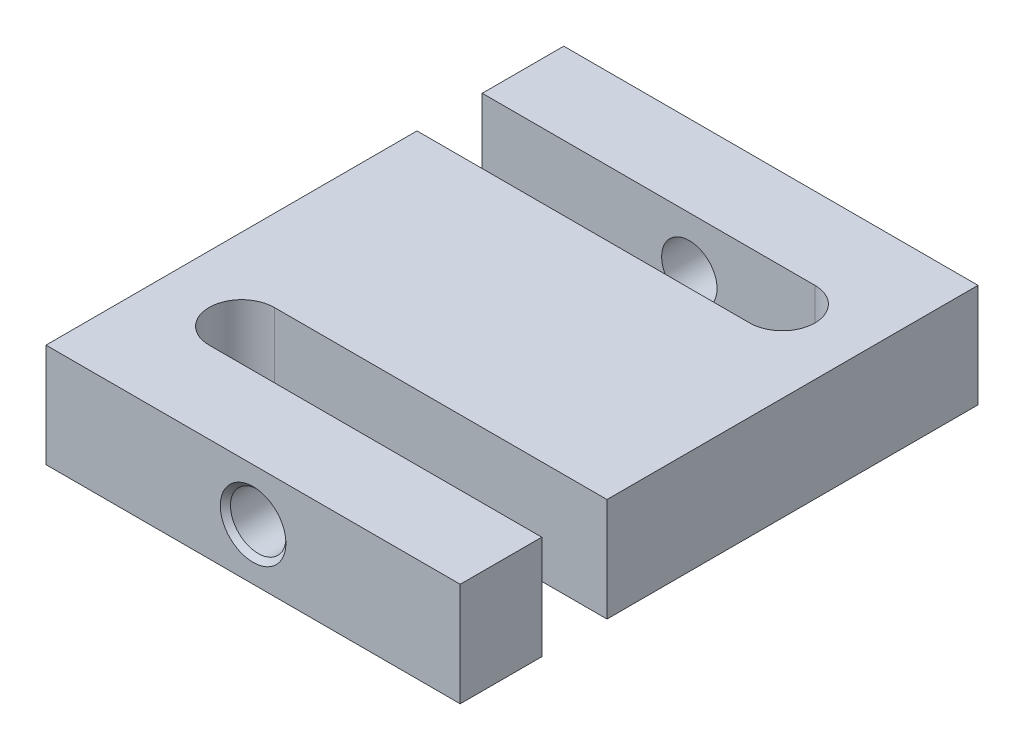
ISO-10303-21;
HEADER;
FILE_DESCRIPTION(('STEP AP214'),'2;1');
FILE_NAME('part.step','',(''),(''),'','','');
FILE_SCHEMA(('AUTOMOTIVE_DESIGN { 1 0 10303 214 1 1 1 1 }'));
ENDSEC;
DATA;
#1=APPLICATION_CONTEXT('core data for automotive mechanical design processes');
#2=APPLICATION_PROTOCOL_DEFINITION('international standard','automotive_design',2000,#1);
#3=PRODUCT_CONTEXT('',#1,'mechanical');
#4=PRODUCT('Part','Part','',(#3));
#5=PRODUCT_RELATED_PRODUCT_CATEGORY('part','',(#4));
#6=PRODUCT_DEFINITION_FORMATION('','',#4);
#7=PRODUCT_DEFINITION_CONTEXT('part definition',#1,'design');
#8=PRODUCT_DEFINITION('design','',#6,#7);
#9=PRODUCT_DEFINITION_SHAPE('','',#8);
#10=(LENGTH_UNIT() NAMED_UNIT(*) SI_UNIT(.MILLI.,.METRE.));
#11=(NAMED_UNIT(*) PLANE_ANGLE_UNIT() SI_UNIT($,.RADIAN.));
#12=(NAMED_UNIT(*) SI_UNIT($,.STERADIAN.) SOLID_ANGLE_UNIT());
#13=UNCERTAINTY_MEASURE_WITH_UNIT(LENGTH_MEASURE(1.E-05),#10,'distance_accuracy_value','');
#14=(GEOMETRIC_REPRESENTATION_CONTEXT(3) GLOBAL_UNCERTAINTY_ASSIGNED_CONTEXT((#13)) GLOBAL_UNIT_ASSIGNED_CONTEXT((#10,
#11,#12)) REPRESENTATION_CONTEXT('',''));
#15=CARTESIAN_POINT('',(0.,0.,0.));
#16=DIRECTION('',(0.,0.,1.));
#17=DIRECTION('',(1.,0.,0.));
#18=AXIS2_PLACEMENT_3D('',#15,#16,#17);
#19=CARTESIAN_POINT('',(0.,12.7,0.));
#20=DIRECTION('',(1.,0.,0.));
#21=DIRECTION('',(0.,0.,-1.));
#22=AXIS2_PLACEMENT_3D('',#19,#20,#21);
#23=PLANE('',#22);
#24=DIRECTION('',(0.,0.,1.));
#25=VECTOR('',#24,1.);
#26=CARTESIAN_POINT('',(0.,0.,0.));
#27=LINE('',#26,#25);
#28=CARTESIAN_POINT('',(0.,0.,-63.5));
#29=VERTEX_POINT('',#28);
#30=CARTESIAN_POINT('',(0.,0.,-53.5));
#31=VERTEX_POINT('',#30);
#32=EDGE_CURVE('E164',#29,#31,#27,.T.);
#33=ORIENTED_EDGE('',*,*,#32,.T.);
#34=DIRECTION('',(0.,1.,0.));
#35=VECTOR('',#34,1.);
#36=CARTESIAN_POINT('',(0.,0.,-53.5));
#37=LINE('',#36,#35);
#38=CARTESIAN_POINT('',(0.,12.7,-53.5));
#39=VERTEX_POINT('',#38);
#40=EDGE_CURVE('E200',#31,#39,#37,.T.);
#41=ORIENTED_EDGE('',*,*,#40,.T.);
#42=DIRECTION('',(0.,0.,1.));
#43=VECTOR('',#42,1.);
#44=CARTESIAN_POINT('',(0.,12.7,0.));
#45=LINE('',#44,#43);
#46=CARTESIAN_POINT('',(0.,12.7,-63.5));
#47=VERTEX_POINT('',#46);
#48=EDGE_CURVE('E265',#47,#39,#45,.T.);
#49=ORIENTED_EDGE('',*,*,#48,.F.);
#50=DIRECTION('',(0.,-1.,0.));
#51=VECTOR('',#50,1.);
#52=CARTESIAN_POINT('',(0.,12.7,-63.5));
#53=LINE('',#52,#51);
#54=EDGE_CURVE('E187',#47,#29,#53,.T.);
#55=ORIENTED_EDGE('',*,*,#54,.T.);
#56=EDGE_LOOP('',(#33,#41,#49,#55));
#57=FACE_BOUND('',#56,.T.);
#58=ADVANCED_FACE('F47',(#57),#23,.F.);
#59=CARTESIAN_POINT('',(50.8,12.7,0.));
#60=DIRECTION('',(-1.,0.,0.));
#61=DIRECTION('',(0.,0.,1.));
#62=AXIS2_PLACEMENT_3D('',#59,#60,#61);
#63=PLANE('',#62);
#64=DIRECTION('',(0.,0.,-1.));
#65=VECTOR('',#64,1.);
#66=CARTESIAN_POINT('',(50.8,0.,0.));
#67=LINE('',#66,#65);
#68=CARTESIAN_POINT('',(50.8,0.,0.));
#69=VERTEX_POINT('',#68);
#70=CARTESIAN_POINT('',(50.8,0.,-10.));
#71=VERTEX_POINT('',#70);
#72=EDGE_CURVE('E180',#69,#71,#67,.T.);
#73=ORIENTED_EDGE('',*,*,#72,.T.);
#74=DIRECTION('',(0.,1.,0.));
#75=VECTOR('',#74,1.);
#76=CARTESIAN_POINT('',(50.8,0.,-10.));
#77=LINE('',#76,#75);
#78=CARTESIAN_POINT('',(50.8,12.7,-10.));
#79=VERTEX_POINT('',#78);
#80=EDGE_CURVE('E230',#71,#79,#77,.T.);
#81=ORIENTED_EDGE('',*,*,#80,.T.);
#82=DIRECTION('',(0.,0.,-1.));
#83=VECTOR('',#82,1.);
#84=CARTESIAN_POINT('',(50.8,12.7,0.));
#85=LINE('',#84,#83);
#86=CARTESIAN_POINT('',(50.8,12.7,0.));
#87=VERTEX_POINT('',#86);
#88=EDGE_CURVE('E271',#87,#79,#85,.T.);
#89=ORIENTED_EDGE('',*,*,#88,.F.);
#90=DIRECTION('',(0.,-1.,0.));
#91=VECTOR('',#90,1.);
#92=CARTESIAN_POINT('',(50.8,12.7,0.));
#93=LINE('',#92,#91);
#94=EDGE_CURVE('E57',#87,#69,#93,.T.);
#95=ORIENTED_EDGE('',*,*,#94,.T.);
#96=EDGE_LOOP('',(#73,#81,#89,#95));
#97=FACE_BOUND('',#96,.T.);
#98=ADVANCED_FACE('F321',(#97),#63,.F.);
#99=CARTESIAN_POINT('',(0.,12.7,-45.5));
#100=VERTEX_POINT('',#99);
#101=CARTESIAN_POINT('',(0.,12.7,0.));
#102=VERTEX_POINT('',#101);
#103=EDGE_CURVE('E155',#100,#102,#45,.T.);
#104=ORIENTED_EDGE('',*,*,#103,.F.);
#105=DIRECTION('',(0.,1.,0.));
#106=VECTOR('',#105,1.);
#107=CARTESIAN_POINT('',(0.,0.,-45.5));
#108=LINE('',#107,#106);
#109=CARTESIAN_POINT('',(0.,0.,-45.5));
#110=VERTEX_POINT('',#109);
#111=EDGE_CURVE('E142',#110,#100,#108,.T.);
#112=ORIENTED_EDGE('',*,*,#111,.F.);
#113=CARTESIAN_POINT('',(0.,0.,0.));
#114=VERTEX_POINT('',#113);
#115=EDGE_CURVE('E153',#110,#114,#27,.T.);
#116=ORIENTED_EDGE('',*,*,#115,.T.);
#117=DIRECTION('',(0.,-1.,0.));
#118=VECTOR('',#117,1.);
#119=CARTESIAN_POINT('',(0.,12.7,0.));
#120=LINE('',#119,#118);
#121=EDGE_CURVE('E11',#102,#114,#120,.T.);
#122=ORIENTED_EDGE('',*,*,#121,.F.);
#123=EDGE_LOOP('',(#104,#112,#116,#122));
#124=FACE_BOUND('',#123,.T.);
#125=ADVANCED_FACE('F49',(#124),#23,.F.);
#126=CARTESIAN_POINT('',(0.,12.7,0.));
#127=DIRECTION('',(0.,0.,-1.));
#128=DIRECTION('',(-1.,0.,0.));
#129=AXIS2_PLACEMENT_3D('',#126,#127,#128);
#130=PLANE('',#129);
#131=CARTESIAN_POINT('',(25.4,6.35,0.));
#132=DIRECTION('',(0.,0.,1.));
#133=DIRECTION('',(1.,0.,0.));
#134=AXIS2_PLACEMENT_3D('',#131,#132,#133);
#135=CIRCLE('',#134,4.025);
#136=CARTESIAN_POINT('',(29.425,6.35,0.));
#137=VERTEX_POINT('',#136);
#138=EDGE_CURVE('E206',#137,#137,#135,.T.);
#139=ORIENTED_EDGE('',*,*,#138,.F.);
#140=EDGE_LOOP('',(#139));
#141=FACE_BOUND('',#140,.T.);
#142=DIRECTION('',(1.,0.,0.));
#143=VECTOR('',#142,1.);
#144=CARTESIAN_POINT('',(0.,0.,0.));
#145=LINE('',#144,#143);
#146=EDGE_CURVE('E162',#114,#69,#145,.T.);
#147=ORIENTED_EDGE('',*,*,#146,.T.);
#148=ORIENTED_EDGE('',*,*,#94,.F.);
#149=DIRECTION('',(1.,0.,0.));
#150=VECTOR('',#149,1.);
#151=CARTESIAN_POINT('',(0.,12.7,0.));
#152=LINE('',#151,#150);
#153=EDGE_CURVE('E268',#102,#87,#152,.T.);
#154=ORIENTED_EDGE('',*,*,#153,.F.);
#155=ORIENTED_EDGE('',*,*,#121,.T.);
#156=EDGE_LOOP('',(#147,#148,#154,#155));
#157=FACE_BOUND('',#156,.T.);
#158=ADVANCED_FACE('F328',(#141,#157),#130,.F.);
#159=CARTESIAN_POINT('',(50.8,12.7,-18.));
#160=VERTEX_POINT('',#159);
#161=CARTESIAN_POINT('',(50.8,12.7,-63.5));
#162=VERTEX_POINT('',#161);
#163=EDGE_CURVE('E270',#160,#162,#85,.T.);
#164=ORIENTED_EDGE('',*,*,#163,.F.);
#165=DIRECTION('',(0.,1.,0.));
#166=VECTOR('',#165,1.);
#167=CARTESIAN_POINT('',(50.8,0.,-18.));
#168=LINE('',#167,#166);
#169=CARTESIAN_POINT('',(50.8,0.,-18.));
#170=VERTEX_POINT('',#169);
#171=EDGE_CURVE('E220',#170,#160,#168,.T.);
#172=ORIENTED_EDGE('',*,*,#171,.F.);
#173=CARTESIAN_POINT('',(50.8,0.,-63.5));
#174=VERTEX_POINT('',#173);
#175=EDGE_CURVE('E179',#170,#174,#67,.T.);
#176=ORIENTED_EDGE('',*,*,#175,.T.);
#177=DIRECTION('',(0.,-1.,0.));
#178=VECTOR('',#177,1.);
#179=CARTESIAN_POINT('',(50.8,12.7,-63.5));
#180=LINE('',#179,#178);
#181=EDGE_CURVE('E191',#162,#174,#180,.T.);
#182=ORIENTED_EDGE('',*,*,#181,.F.);
#183=EDGE_LOOP('',(#164,#172,#176,#182));
#184=FACE_BOUND('',#183,.T.);
#185=ADVANCED_FACE('F288',(#184),#63,.F.);
#186=CARTESIAN_POINT('',(0.,12.7,-63.5));
#187=DIRECTION('',(0.,0.,1.));
#188=DIRECTION('',(1.,0.,0.));
#189=AXIS2_PLACEMENT_3D('',#186,#187,#188);
#190=PLANE('',#189);
#191=CARTESIAN_POINT('',(25.4,6.35,-63.5));
#192=DIRECTION('',(0.,0.,-1.));
#193=DIRECTION('',(-1.,0.,0.));
#194=AXIS2_PLACEMENT_3D('',#191,#192,#193);
#195=CIRCLE('',#194,4.025);
#196=CARTESIAN_POINT('',(21.375,6.35,-63.5));
#197=VERTEX_POINT('',#196);
#198=EDGE_CURVE('E171',#197,#197,#195,.T.);
#199=ORIENTED_EDGE('',*,*,#198,.F.);
#200=EDGE_LOOP('',(#199));
#201=FACE_BOUND('',#200,.T.);
#202=DIRECTION('',(-1.,0.,0.));
#203=VECTOR('',#202,1.);
#204=CARTESIAN_POINT('',(0.,0.,-63.5));
#205=LINE('',#204,#203);
#206=EDGE_CURVE('E184',#174,#29,#205,.T.);
#207=ORIENTED_EDGE('',*,*,#206,.T.);
#208=ORIENTED_EDGE('',*,*,#54,.F.);
#209=DIRECTION('',(-1.,0.,0.));
#210=VECTOR('',#209,1.);
#211=CARTESIAN_POINT('',(0.,12.7,-63.5));
#212=LINE('',#211,#210);
#213=EDGE_CURVE('E175',#162,#47,#212,.T.);
#214=ORIENTED_EDGE('',*,*,#213,.F.);
#215=ORIENTED_EDGE('',*,*,#181,.T.);
#216=EDGE_LOOP('',(#207,#208,#214,#215));
#217=FACE_BOUND('',#216,.T.);
#218=ADVANCED_FACE('F292',(#201,#217),#190,.F.);
#219=CARTESIAN_POINT('',(0.,12.7,0.));
#220=DIRECTION('',(0.,-1.,0.));
#221=DIRECTION('',(0.,0.,-1.));
#222=AXIS2_PLACEMENT_3D('',#219,#220,#221);
#223=PLANE('',#222);
#224=ORIENTED_EDGE('',*,*,#48,.T.);
#225=DIRECTION('',(-1.,0.,0.));
#226=VECTOR('',#225,1.);
#227=CARTESIAN_POINT('',(0.,12.7,-53.5));
#228=LINE('',#227,#226);
#229=CARTESIAN_POINT('',(40.8,12.7,-53.5));
#230=VERTEX_POINT('',#229);
#231=EDGE_CURVE('E148',#230,#39,#228,.T.);
#232=ORIENTED_EDGE('',*,*,#231,.F.);
#233=CARTESIAN_POINT('',(40.8,12.7,-49.5));
#234=DIRECTION('',(0.,1.,0.));
#235=DIRECTION('',(0.,0.,1.));
#236=AXIS2_PLACEMENT_3D('',#233,#234,#235);
#237=CIRCLE('',#236,4.);
#238=CARTESIAN_POINT('',(40.8,12.7,-45.5));
#239=VERTEX_POINT('',#238);
#240=EDGE_CURVE('E297',#239,#230,#237,.T.);
#241=ORIENTED_EDGE('',*,*,#240,.F.);
#242=DIRECTION('',(1.,0.,0.));
#243=VECTOR('',#242,1.);
#244=CARTESIAN_POINT('',(0.,12.7,-45.5));
#245=LINE('',#244,#243);
#246=EDGE_CURVE('E246',#100,#239,#245,.T.);
#247=ORIENTED_EDGE('',*,*,#246,.F.);
#248=ORIENTED_EDGE('',*,*,#103,.T.);
#249=ORIENTED_EDGE('',*,*,#153,.T.);
#250=ORIENTED_EDGE('',*,*,#88,.T.);
#251=DIRECTION('',(1.,0.,0.));
#252=VECTOR('',#251,1.);
#253=CARTESIAN_POINT('',(50.8,12.7,-10.));
#254=LINE('',#253,#252);
#255=CARTESIAN_POINT('',(10.,12.7,-9.99999999999999));
#256=VERTEX_POINT('',#255);
#257=EDGE_CURVE('E234',#256,#79,#254,.T.);
#258=ORIENTED_EDGE('',*,*,#257,.F.);
#259=CARTESIAN_POINT('',(10.,12.7,-14.));
#260=DIRECTION('',(0.,1.,0.));
#261=DIRECTION('',(0.,0.,1.));
#262=AXIS2_PLACEMENT_3D('',#259,#260,#261);
#263=CIRCLE('',#262,4.);
#264=CARTESIAN_POINT('',(10.,12.7,-18.));
#265=VERTEX_POINT('',#264);
#266=EDGE_CURVE('E237',#265,#256,#263,.T.);
#267=ORIENTED_EDGE('',*,*,#266,.F.);
#268=DIRECTION('',(-1.,0.,0.));
#269=VECTOR('',#268,1.);
#270=CARTESIAN_POINT('',(50.8,12.7,-18.));
#271=LINE('',#270,#269);
#272=EDGE_CURVE('E242',#160,#265,#271,.T.);
#273=ORIENTED_EDGE('',*,*,#272,.F.);
#274=ORIENTED_EDGE('',*,*,#163,.T.);
#275=ORIENTED_EDGE('',*,*,#213,.T.);
#276=EDGE_LOOP('',(#224,#232,#241,#247,#248,#249,#250,#258,#267,#273,#274,#275));
#277=FACE_BOUND('',#276,.T.);
#278=ADVANCED_FACE('F282',(#277),#223,.F.);
#279=CARTESIAN_POINT('',(0.,0.,0.));
#280=DIRECTION('',(0.,-1.,0.));
#281=DIRECTION('',(0.,0.,-1.));
#282=AXIS2_PLACEMENT_3D('',#279,#280,#281);
#283=PLANE('',#282);
#284=DIRECTION('',(-1.,0.,0.));
#285=VECTOR('',#284,1.);
#286=CARTESIAN_POINT('',(0.,0.,-53.5));
#287=LINE('',#286,#285);
#288=CARTESIAN_POINT('',(40.8,0.,-53.5));
#289=VERTEX_POINT('',#288);
#290=EDGE_CURVE('E157',#289,#31,#287,.T.);
#291=ORIENTED_EDGE('',*,*,#290,.T.);
#292=ORIENTED_EDGE('',*,*,#32,.F.);
#293=ORIENTED_EDGE('',*,*,#206,.F.);
#294=ORIENTED_EDGE('',*,*,#175,.F.);
#295=DIRECTION('',(-1.,0.,0.));
#296=VECTOR('',#295,1.);
#297=CARTESIAN_POINT('',(50.8,0.,-18.));
#298=LINE('',#297,#296);
#299=CARTESIAN_POINT('',(10.,0.,-18.));
#300=VERTEX_POINT('',#299);
#301=EDGE_CURVE('E238',#170,#300,#298,.T.);
#302=ORIENTED_EDGE('',*,*,#301,.T.);
#303=CARTESIAN_POINT('',(10.,0.,-14.));
#304=DIRECTION('',(0.,1.,0.));
#305=DIRECTION('',(0.,0.,1.));
#306=AXIS2_PLACEMENT_3D('',#303,#304,#305);
#307=CIRCLE('',#306,4.);
#308=CARTESIAN_POINT('',(10.,0.,-9.99999999999999));
#309=VERTEX_POINT('',#308);
#310=EDGE_CURVE('E73',#300,#309,#307,.T.);
#311=ORIENTED_EDGE('',*,*,#310,.T.);
#312=DIRECTION('',(1.,0.,0.));
#313=VECTOR('',#312,1.);
#314=CARTESIAN_POINT('',(50.8,0.,-10.));
#315=LINE('',#314,#313);
#316=EDGE_CURVE('E223',#309,#71,#315,.T.);
#317=ORIENTED_EDGE('',*,*,#316,.T.);
#318=ORIENTED_EDGE('',*,*,#72,.F.);
#319=ORIENTED_EDGE('',*,*,#146,.F.);
#320=ORIENTED_EDGE('',*,*,#115,.F.);
#321=DIRECTION('',(1.,0.,0.));
#322=VECTOR('',#321,1.);
#323=CARTESIAN_POINT('',(0.,0.,-45.5));
#324=LINE('',#323,#322);
#325=CARTESIAN_POINT('',(40.8,0.,-45.5));
#326=VERTEX_POINT('',#325);
#327=EDGE_CURVE('E138',#110,#326,#324,.T.);
#328=ORIENTED_EDGE('',*,*,#327,.T.);
#329=CARTESIAN_POINT('',(40.8,0.,-49.5));
#330=DIRECTION('',(0.,1.,0.));
#331=DIRECTION('',(0.,0.,1.));
#332=AXIS2_PLACEMENT_3D('',#329,#330,#331);
#333=CIRCLE('',#332,4.);
#334=EDGE_CURVE('E65',#326,#289,#333,.T.);
#335=ORIENTED_EDGE('',*,*,#334,.T.);
#336=EDGE_LOOP('',(#291,#292,#293,#294,#302,#311,#317,#318,#319,#320,#328,#335));
#337=FACE_BOUND('',#336,.T.);
#338=ADVANCED_FACE('F160',(#337),#283,.T.);
#339=CARTESIAN_POINT('',(25.4,6.35,-63.5));
#340=DIRECTION('',(0.,0.,-1.));
#341=DIRECTION('',(-1.,0.,0.));
#342=AXIS2_PLACEMENT_3D('',#339,#340,#341);
#343=CYLINDRICAL_SURFACE('',#342,3.4);
#344=CARTESIAN_POINT('',(25.4,6.35,-53.5));
#345=DIRECTION('',(0.,0.,-1.));
#346=DIRECTION('',(-1.,0.,0.));
#347=AXIS2_PLACEMENT_3D('',#344,#345,#346);
#348=CIRCLE('',#347,3.4);
#349=CARTESIAN_POINT('',(22.,6.35,-53.5));
#350=VERTEX_POINT('',#349);
#351=EDGE_CURVE('E51',#350,#350,#348,.F.);
#352=ORIENTED_EDGE('',*,*,#351,.T.);
#353=EDGE_LOOP('',(#352));
#354=FACE_BOUND('',#353,.T.);
#355=CARTESIAN_POINT('',(25.4,6.35,-62.875));
#356=DIRECTION('',(0.,0.,-1.));
#357=DIRECTION('',(-1.,0.,0.));
#358=AXIS2_PLACEMENT_3D('',#355,#356,#357);
#359=CIRCLE('',#358,3.39999999999999);
#360=CARTESIAN_POINT('',(22.,6.35,-62.875));
#361=VERTEX_POINT('',#360);
#362=EDGE_CURVE('E165',#361,#361,#359,.T.);
#363=ORIENTED_EDGE('',*,*,#362,.T.);
#364=EDGE_LOOP('',(#363));
#365=FACE_BOUND('',#364,.T.);
#366=ADVANCED_FACE('F344',(#354,#365),#343,.F.);
#367=CARTESIAN_POINT('',(25.4,6.35,-63.5));
#368=DIRECTION('',(0.,0.,-1.));
#369=DIRECTION('',(-1.,0.,0.));
#370=AXIS2_PLACEMENT_3D('',#367,#368,#369);
#371=CONICAL_SURFACE('',#370,4.025,0.785398163397454);
#372=ORIENTED_EDGE('',*,*,#362,.F.);
#373=EDGE_LOOP('',(#372));
#374=FACE_BOUND('',#373,.T.);
#375=ORIENTED_EDGE('',*,*,#198,.T.);
#376=EDGE_LOOP('',(#375));
#377=FACE_BOUND('',#376,.T.);
#378=ADVANCED_FACE('F349',(#374,#377),#371,.F.);
#379=CARTESIAN_POINT('',(25.4,6.35,0.));
#380=DIRECTION('',(0.,0.,1.));
#381=DIRECTION('',(1.,0.,0.));
#382=AXIS2_PLACEMENT_3D('',#379,#380,#381);
#383=CYLINDRICAL_SURFACE('',#382,3.39999999999999);
#384=CARTESIAN_POINT('',(25.4,6.35,-10.));
#385=DIRECTION('',(0.,0.,1.));
#386=DIRECTION('',(1.,0.,0.));
#387=AXIS2_PLACEMENT_3D('',#384,#385,#386);
#388=CIRCLE('',#387,3.39999999999999);
#389=CARTESIAN_POINT('',(28.8,6.35,-10.));
#390=VERTEX_POINT('',#389);
#391=EDGE_CURVE('E197',#390,#390,#388,.F.);
#392=ORIENTED_EDGE('',*,*,#391,.T.);
#393=EDGE_LOOP('',(#392));
#394=FACE_BOUND('',#393,.T.);
#395=CARTESIAN_POINT('',(25.4,6.35,-0.625000000000014));
#396=DIRECTION('',(0.,0.,1.));
#397=DIRECTION('',(1.,0.,0.));
#398=AXIS2_PLACEMENT_3D('',#395,#396,#397);
#399=CIRCLE('',#398,3.39999999999999);
#400=CARTESIAN_POINT('',(28.8,6.35,-0.625000000000014));
#401=VERTEX_POINT('',#400);
#402=EDGE_CURVE('E258',#401,#401,#399,.T.);
#403=ORIENTED_EDGE('',*,*,#402,.T.);
#404=EDGE_LOOP('',(#403));
#405=FACE_BOUND('',#404,.T.);
#406=ADVANCED_FACE('F353',(#394,#405),#383,.F.);
#407=CARTESIAN_POINT('',(25.4,6.35,0.));
#408=DIRECTION('',(0.,0.,1.));
#409=DIRECTION('',(1.,0.,0.));
#410=AXIS2_PLACEMENT_3D('',#407,#408,#409);
#411=CONICAL_SURFACE('',#410,4.025,0.785398163397447);
#412=ORIENTED_EDGE('',*,*,#402,.F.);
#413=EDGE_LOOP('',(#412));
#414=FACE_BOUND('',#413,.T.);
#415=ORIENTED_EDGE('',*,*,#138,.T.);
#416=EDGE_LOOP('',(#415));
#417=FACE_BOUND('',#416,.T.);
#418=ADVANCED_FACE('F357',(#414,#417),#411,.F.);
#419=CARTESIAN_POINT('',(50.8,0.,-10.));
#420=DIRECTION('',(0.,0.,1.));
#421=DIRECTION('',(1.,0.,0.));
#422=AXIS2_PLACEMENT_3D('',#419,#420,#421);
#423=PLANE('',#422);
#424=ORIENTED_EDGE('',*,*,#257,.T.);
#425=ORIENTED_EDGE('',*,*,#80,.F.);
#426=ORIENTED_EDGE('',*,*,#316,.F.);
#427=DIRECTION('',(0.,1.,0.));
#428=VECTOR('',#427,1.);
#429=CARTESIAN_POINT('',(10.,0.,-9.99999999999999));
#430=LINE('',#429,#428);
#431=EDGE_CURVE('E227',#309,#256,#430,.T.);
#432=ORIENTED_EDGE('',*,*,#431,.T.);
#433=EDGE_LOOP('',(#424,#425,#426,#432));
#434=FACE_BOUND('',#433,.T.);
#435=ORIENTED_EDGE('',*,*,#391,.F.);
#436=EDGE_LOOP('',(#435));
#437=FACE_BOUND('',#436,.T.);
#438=ADVANCED_FACE('F360',(#434,#437),#423,.F.);
#439=CARTESIAN_POINT('',(10.,0.,-14.));
#440=DIRECTION('',(0.,1.,0.));
#441=DIRECTION('',(0.,0.,1.));
#442=AXIS2_PLACEMENT_3D('',#439,#440,#441);
#443=CYLINDRICAL_SURFACE('',#442,4.);
#444=ORIENTED_EDGE('',*,*,#266,.T.);
#445=ORIENTED_EDGE('',*,*,#431,.F.);
#446=ORIENTED_EDGE('',*,*,#310,.F.);
#447=DIRECTION('',(0.,1.,0.));
#448=VECTOR('',#447,1.);
#449=CARTESIAN_POINT('',(10.,0.,-18.));
#450=LINE('',#449,#448);
#451=EDGE_CURVE('E224',#300,#265,#450,.T.);
#452=ORIENTED_EDGE('',*,*,#451,.T.);
#453=EDGE_LOOP('',(#444,#445,#446,#452));
#454=FACE_BOUND('',#453,.T.);
#455=ADVANCED_FACE('F364',(#454),#443,.F.);
#456=CARTESIAN_POINT('',(50.8,0.,-18.));
#457=DIRECTION('',(0.,0.,-1.));
#458=DIRECTION('',(-1.,0.,0.));
#459=AXIS2_PLACEMENT_3D('',#456,#457,#458);
#460=PLANE('',#459);
#461=ORIENTED_EDGE('',*,*,#272,.T.);
#462=ORIENTED_EDGE('',*,*,#451,.F.);
#463=ORIENTED_EDGE('',*,*,#301,.F.);
#464=ORIENTED_EDGE('',*,*,#171,.T.);
#465=EDGE_LOOP('',(#461,#462,#463,#464));
#466=FACE_BOUND('',#465,.T.);
#467=ADVANCED_FACE('F318',(#466),#460,.F.);
#468=CARTESIAN_POINT('',(0.,0.,-53.5));
#469=DIRECTION('',(0.,0.,-1.));
#470=DIRECTION('',(-1.,0.,0.));
#471=AXIS2_PLACEMENT_3D('',#468,#469,#470);
#472=PLANE('',#471);
#473=ORIENTED_EDGE('',*,*,#231,.T.);
#474=ORIENTED_EDGE('',*,*,#40,.F.);
#475=ORIENTED_EDGE('',*,*,#290,.F.);
#476=DIRECTION('',(0.,1.,0.));
#477=VECTOR('',#476,1.);
#478=CARTESIAN_POINT('',(40.8,0.,-53.5));
#479=LINE('',#478,#477);
#480=EDGE_CURVE('E208',#289,#230,#479,.T.);
#481=ORIENTED_EDGE('',*,*,#480,.T.);
#482=EDGE_LOOP('',(#473,#474,#475,#481));
#483=FACE_BOUND('',#482,.T.);
#484=ORIENTED_EDGE('',*,*,#351,.F.);
#485=EDGE_LOOP('',(#484));
#486=FACE_BOUND('',#485,.T.);
#487=ADVANCED_FACE('F308',(#483,#486),#472,.F.);
#488=CARTESIAN_POINT('',(40.8,0.,-49.5));
#489=DIRECTION('',(0.,1.,0.));
#490=DIRECTION('',(0.,0.,1.));
#491=AXIS2_PLACEMENT_3D('',#488,#489,#490);
#492=CYLINDRICAL_SURFACE('',#491,4.);
#493=ORIENTED_EDGE('',*,*,#240,.T.);
#494=ORIENTED_EDGE('',*,*,#480,.F.);
#495=ORIENTED_EDGE('',*,*,#334,.F.);
#496=DIRECTION('',(0.,1.,0.));
#497=VECTOR('',#496,1.);
#498=CARTESIAN_POINT('',(40.8,0.,-45.5));
#499=LINE('',#498,#497);
#500=EDGE_CURVE('E144',#326,#239,#499,.T.);
#501=ORIENTED_EDGE('',*,*,#500,.T.);
#502=EDGE_LOOP('',(#493,#494,#495,#501));
#503=FACE_BOUND('',#502,.T.);
#504=ADVANCED_FACE('F310',(#503),#492,.F.);
#505=CARTESIAN_POINT('',(0.,0.,-45.5));
#506=DIRECTION('',(0.,0.,1.));
#507=DIRECTION('',(1.,0.,0.));
#508=AXIS2_PLACEMENT_3D('',#505,#506,#507);
#509=PLANE('',#508);
#510=ORIENTED_EDGE('',*,*,#246,.T.);
#511=ORIENTED_EDGE('',*,*,#500,.F.);
#512=ORIENTED_EDGE('',*,*,#327,.F.);
#513=ORIENTED_EDGE('',*,*,#111,.T.);
#514=EDGE_LOOP('',(#510,#511,#512,#513));
#515=FACE_BOUND('',#514,.T.);
#516=ADVANCED_FACE('F141',(#515),#509,.F.);
#517=CLOSED_SHELL('',(#58,#98,#125,#158,#185,#218,#278,#338,#366,#378,#406,#418,#438,#455,#467,
#487,#504,#516));
#518=MANIFOLD_SOLID_BREP('B2',#517);
#519=ADVANCED_BREP_SHAPE_REPRESENTATION('',(#18,#518),#14);
#520=SHAPE_DEFINITION_REPRESENTATION(#9,#519);
ENDSEC;
END-ISO-10303-21;
